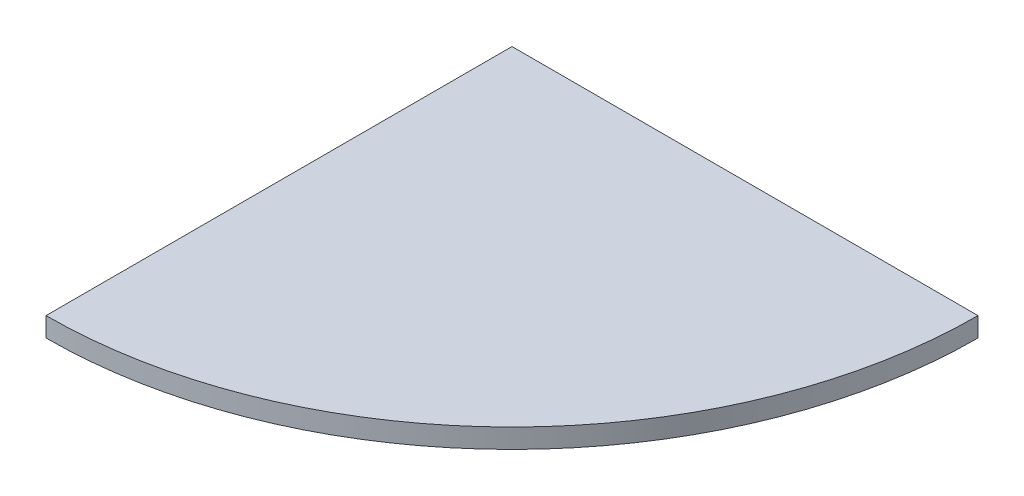
ISO-10303-21;
HEADER;
FILE_DESCRIPTION(('STEP AP214'),'2;1');
FILE_NAME('part.step','',(''),(''),'','','');
FILE_SCHEMA(('AUTOMOTIVE_DESIGN { 1 0 10303 214 1 1 1 1 }'));
ENDSEC;
DATA;
#1=APPLICATION_CONTEXT('core data for automotive mechanical design processes');
#2=APPLICATION_PROTOCOL_DEFINITION('international standard','automotive_design',2000,#1);
#3=PRODUCT_CONTEXT('',#1,'mechanical');
#4=PRODUCT('Part','Part','',(#3));
#5=PRODUCT_RELATED_PRODUCT_CATEGORY('part','',(#4));
#6=PRODUCT_DEFINITION_FORMATION('','',#4);
#7=PRODUCT_DEFINITION_CONTEXT('part definition',#1,'design');
#8=PRODUCT_DEFINITION('design','',#6,#7);
#9=PRODUCT_DEFINITION_SHAPE('','',#8);
#10=(LENGTH_UNIT() NAMED_UNIT(*) SI_UNIT(.MILLI.,.METRE.));
#11=(NAMED_UNIT(*) PLANE_ANGLE_UNIT() SI_UNIT($,.RADIAN.));
#12=(NAMED_UNIT(*) SI_UNIT($,.STERADIAN.) SOLID_ANGLE_UNIT());
#13=UNCERTAINTY_MEASURE_WITH_UNIT(LENGTH_MEASURE(1.E-05),#10,'distance_accuracy_value','');
#14=(GEOMETRIC_REPRESENTATION_CONTEXT(3) GLOBAL_UNCERTAINTY_ASSIGNED_CONTEXT((#13)) GLOBAL_UNIT_ASSIGNED_CONTEXT((#10,
#11,#12)) REPRESENTATION_CONTEXT('',''));
#15=CARTESIAN_POINT('',(0.,0.,0.));
#16=DIRECTION('',(0.,0.,1.));
#17=DIRECTION('',(1.,0.,0.));
#18=AXIS2_PLACEMENT_3D('',#15,#16,#17);
#19=CARTESIAN_POINT('',(0.,18.,0.));
#20=DIRECTION('',(0.,0.,1.));
#21=DIRECTION('',(1.,0.,0.));
#22=AXIS2_PLACEMENT_3D('',#19,#20,#21);
#23=PLANE('',#22);
#24=DIRECTION('',(-1.,0.,0.));
#25=VECTOR('',#24,1.);
#26=CARTESIAN_POINT('',(0.,0.,0.));
#27=LINE('',#26,#25);
#28=CARTESIAN_POINT('',(432.,0.,0.));
#29=VERTEX_POINT('',#28);
#30=CARTESIAN_POINT('',(0.,0.,0.));
#31=VERTEX_POINT('',#30);
#32=EDGE_CURVE('E80',#29,#31,#27,.T.);
#33=ORIENTED_EDGE('',*,*,#32,.T.);
#34=DIRECTION('',(0.,-1.,0.));
#35=VECTOR('',#34,1.);
#36=CARTESIAN_POINT('',(0.,18.,0.));
#37=LINE('',#36,#35);
#38=CARTESIAN_POINT('',(0.,18.,0.));
#39=VERTEX_POINT('',#38);
#40=EDGE_CURVE('E11',#39,#31,#37,.T.);
#41=ORIENTED_EDGE('',*,*,#40,.F.);
#42=DIRECTION('',(-1.,0.,0.));
#43=VECTOR('',#42,1.);
#44=CARTESIAN_POINT('',(0.,18.,0.));
#45=LINE('',#44,#43);
#46=CARTESIAN_POINT('',(432.,18.,0.));
#47=VERTEX_POINT('',#46);
#48=EDGE_CURVE('E73',#47,#39,#45,.T.);
#49=ORIENTED_EDGE('',*,*,#48,.F.);
#50=DIRECTION('',(0.,-1.,0.));
#51=VECTOR('',#50,1.);
#52=CARTESIAN_POINT('',(432.,18.,0.));
#53=LINE('',#52,#51);
#54=EDGE_CURVE('E81',#47,#29,#53,.T.);
#55=ORIENTED_EDGE('',*,*,#54,.T.);
#56=EDGE_LOOP('',(#33,#41,#49,#55));
#57=FACE_BOUND('',#56,.T.);
#58=ADVANCED_FACE('F33',(#57),#23,.F.);
#59=CARTESIAN_POINT('',(0.,18.,0.));
#60=DIRECTION('',(1.,0.,0.));
#61=DIRECTION('',(0.,0.,-1.));
#62=AXIS2_PLACEMENT_3D('',#59,#60,#61);
#63=PLANE('',#62);
#64=DIRECTION('',(0.,0.,1.));
#65=VECTOR('',#64,1.);
#66=CARTESIAN_POINT('',(0.,0.,0.));
#67=LINE('',#66,#65);
#68=CARTESIAN_POINT('',(0.,0.,432.));
#69=VERTEX_POINT('',#68);
#70=EDGE_CURVE('E61',#31,#69,#67,.T.);
#71=ORIENTED_EDGE('',*,*,#70,.T.);
#72=DIRECTION('',(0.,-1.,0.));
#73=VECTOR('',#72,1.);
#74=CARTESIAN_POINT('',(0.,18.,432.));
#75=LINE('',#74,#73);
#76=CARTESIAN_POINT('',(0.,18.,432.));
#77=VERTEX_POINT('',#76);
#78=EDGE_CURVE('E41',#77,#69,#75,.T.);
#79=ORIENTED_EDGE('',*,*,#78,.F.);
#80=DIRECTION('',(0.,0.,1.));
#81=VECTOR('',#80,1.);
#82=CARTESIAN_POINT('',(0.,18.,0.));
#83=LINE('',#82,#81);
#84=EDGE_CURVE('E69',#39,#77,#83,.T.);
#85=ORIENTED_EDGE('',*,*,#84,.F.);
#86=ORIENTED_EDGE('',*,*,#40,.T.);
#87=EDGE_LOOP('',(#71,#79,#85,#86));
#88=FACE_BOUND('',#87,.T.);
#89=ADVANCED_FACE('F70',(#88),#63,.F.);
#90=CARTESIAN_POINT('',(0.,18.,0.));
#91=DIRECTION('',(0.,-1.,0.));
#92=DIRECTION('',(0.,0.,-1.));
#93=AXIS2_PLACEMENT_3D('',#90,#91,#92);
#94=CYLINDRICAL_SURFACE('',#93,432.);
#95=CARTESIAN_POINT('',(0.,0.,0.));
#96=DIRECTION('',(0.,1.,0.));
#97=DIRECTION('',(0.,0.,-1.));
#98=AXIS2_PLACEMENT_3D('',#95,#96,#97);
#99=CIRCLE('',#98,432.);
#100=EDGE_CURVE('E66',#69,#29,#99,.T.);
#101=ORIENTED_EDGE('',*,*,#100,.T.);
#102=ORIENTED_EDGE('',*,*,#54,.F.);
#103=CARTESIAN_POINT('',(0.,18.,0.));
#104=DIRECTION('',(0.,1.,0.));
#105=DIRECTION('',(0.,0.,-1.));
#106=AXIS2_PLACEMENT_3D('',#103,#104,#105);
#107=CIRCLE('',#106,432.);
#108=EDGE_CURVE('E49',#77,#47,#107,.T.);
#109=ORIENTED_EDGE('',*,*,#108,.F.);
#110=ORIENTED_EDGE('',*,*,#78,.T.);
#111=EDGE_LOOP('',(#101,#102,#109,#110));
#112=FACE_BOUND('',#111,.T.);
#113=ADVANCED_FACE('F88',(#112),#94,.T.);
#114=CARTESIAN_POINT('',(0.,18.,0.));
#115=DIRECTION('',(0.,-1.,0.));
#116=DIRECTION('',(0.,0.,-1.));
#117=AXIS2_PLACEMENT_3D('',#114,#115,#116);
#118=PLANE('',#117);
#119=ORIENTED_EDGE('',*,*,#48,.T.);
#120=ORIENTED_EDGE('',*,*,#84,.T.);
#121=ORIENTED_EDGE('',*,*,#108,.T.);
#122=EDGE_LOOP('',(#119,#120,#121));
#123=FACE_BOUND('',#122,.T.);
#124=ADVANCED_FACE('F76',(#123),#118,.F.);
#125=CARTESIAN_POINT('',(0.,0.,0.));
#126=DIRECTION('',(0.,-1.,0.));
#127=DIRECTION('',(0.,0.,-1.));
#128=AXIS2_PLACEMENT_3D('',#125,#126,#127);
#129=PLANE('',#128);
#130=ORIENTED_EDGE('',*,*,#32,.F.);
#131=ORIENTED_EDGE('',*,*,#100,.F.);
#132=ORIENTED_EDGE('',*,*,#70,.F.);
#133=EDGE_LOOP('',(#130,#131,#132));
#134=FACE_BOUND('',#133,.T.);
#135=ADVANCED_FACE('F89',(#134),#129,.T.);
#136=CLOSED_SHELL('',(#58,#89,#113,#124,#135));
#137=MANIFOLD_SOLID_BREP('B2',#136);
#138=ADVANCED_BREP_SHAPE_REPRESENTATION('',(#18,#137),#14);
#139=SHAPE_DEFINITION_REPRESENTATION(#9,#138);
ENDSEC;
END-ISO-10303-21;
